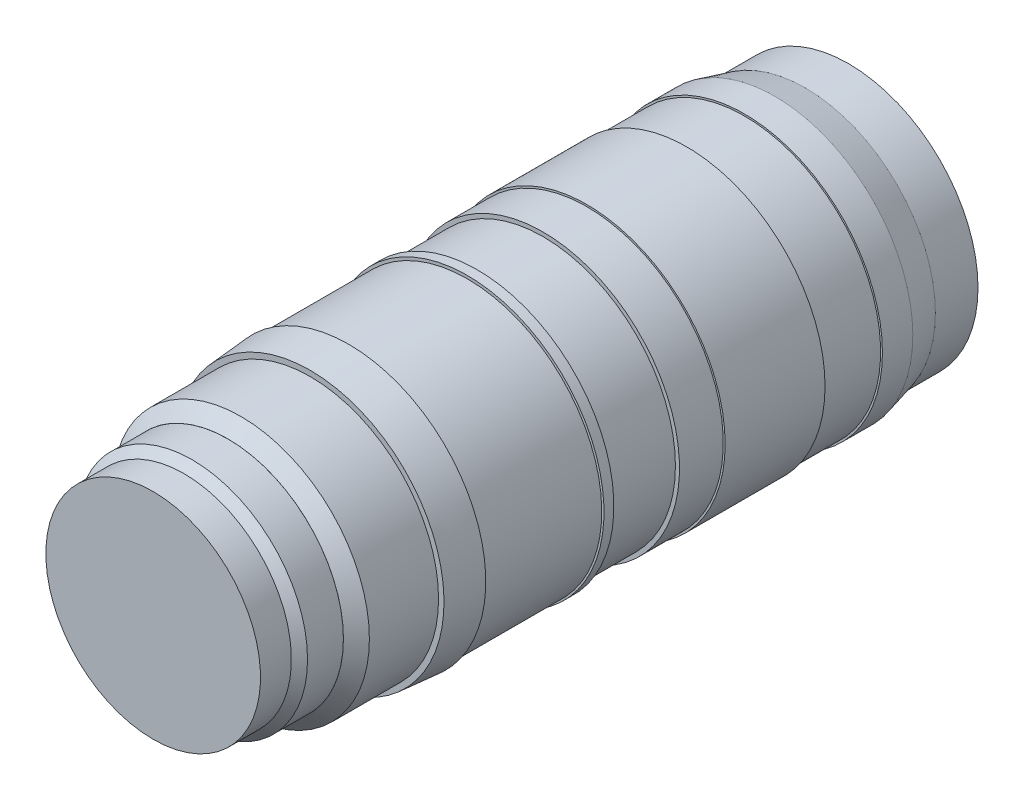
ISO-10303-21;
HEADER;
FILE_DESCRIPTION(('STEP AP214'),'2;1');
FILE_NAME('part.step','',(''),(''),'','','');
FILE_SCHEMA(('AUTOMOTIVE_DESIGN { 1 0 10303 214 1 1 1 1 }'));
ENDSEC;
DATA;
#1=APPLICATION_CONTEXT('core data for automotive mechanical design processes');
#2=APPLICATION_PROTOCOL_DEFINITION('international standard','automotive_design',2000,#1);
#3=PRODUCT_CONTEXT('',#1,'mechanical');
#4=PRODUCT('Part','Part','',(#3));
#5=PRODUCT_RELATED_PRODUCT_CATEGORY('part','',(#4));
#6=PRODUCT_DEFINITION_FORMATION('','',#4);
#7=PRODUCT_DEFINITION_CONTEXT('part definition',#1,'design');
#8=PRODUCT_DEFINITION('design','',#6,#7);
#9=PRODUCT_DEFINITION_SHAPE('','',#8);
#10=(LENGTH_UNIT() NAMED_UNIT(*) SI_UNIT(.MILLI.,.METRE.));
#11=(NAMED_UNIT(*) PLANE_ANGLE_UNIT() SI_UNIT($,.RADIAN.));
#12=(NAMED_UNIT(*) SI_UNIT($,.STERADIAN.) SOLID_ANGLE_UNIT());
#13=UNCERTAINTY_MEASURE_WITH_UNIT(LENGTH_MEASURE(1.E-05),#10,'distance_accuracy_value','');
#14=(GEOMETRIC_REPRESENTATION_CONTEXT(3) GLOBAL_UNCERTAINTY_ASSIGNED_CONTEXT((#13)) GLOBAL_UNIT_ASSIGNED_CONTEXT((#10,
#11,#12)) REPRESENTATION_CONTEXT('',''));
#15=CARTESIAN_POINT('',(0.,0.,0.));
#16=DIRECTION('',(0.,0.,1.));
#17=DIRECTION('',(1.,0.,0.));
#18=AXIS2_PLACEMENT_3D('',#15,#16,#17);
#19=CARTESIAN_POINT('',(0.,-0.223974787347825,203.2));
#20=DIRECTION('',(0.,0.,1.));
#21=DIRECTION('',(0.,-1.,0.));
#22=AXIS2_PLACEMENT_3D('',#19,#20,#21);
#23=PLANE('',#22);
#24=CARTESIAN_POINT('',(0.,-0.223974787347825,203.2));
#25=DIRECTION('',(0.,0.,-1.));
#26=DIRECTION('',(0.,1.,0.));
#27=AXIS2_PLACEMENT_3D('',#24,#25,#26);
#28=CIRCLE('',#27,32.595);
#29=CARTESIAN_POINT('',(0.,32.3710252126522,203.2));
#30=VERTEX_POINT('',#29);
#31=EDGE_CURVE('E135',#30,#30,#28,.T.);
#32=ORIENTED_EDGE('',*,*,#31,.F.);
#33=EDGE_LOOP('',(#32));
#34=FACE_BOUND('',#33,.T.);
#35=ADVANCED_FACE('F38',(#34),#23,.T.);
#36=CARTESIAN_POINT('',(0.,-0.223974787347814,107.78));
#37=DIRECTION('',(0.,0.,-1.));
#38=DIRECTION('',(0.,1.,0.));
#39=AXIS2_PLACEMENT_3D('',#36,#37,#38);
#40=CYLINDRICAL_SURFACE('',#39,32.595);
#41=CARTESIAN_POINT('',(0.,-0.223974787347824,193.81));
#42=DIRECTION('',(0.,0.,-1.));
#43=DIRECTION('',(0.,1.,0.));
#44=AXIS2_PLACEMENT_3D('',#41,#42,#43);
#45=CIRCLE('',#44,32.595);
#46=CARTESIAN_POINT('',(0.,32.3710252126522,193.81));
#47=VERTEX_POINT('',#46);
#48=EDGE_CURVE('E42',#47,#47,#45,.F.);
#49=ORIENTED_EDGE('',*,*,#48,.T.);
#50=EDGE_LOOP('',(#49));
#51=FACE_BOUND('',#50,.T.);
#52=ORIENTED_EDGE('',*,*,#31,.T.);
#53=EDGE_LOOP('',(#52));
#54=FACE_BOUND('',#53,.T.);
#55=ADVANCED_FACE('F169',(#51,#54),#40,.T.);
#56=CARTESIAN_POINT('',(0.,-0.223974787347814,107.78));
#57=DIRECTION('',(0.,0.,-1.));
#58=DIRECTION('',(0.,1.,0.));
#59=AXIS2_PLACEMENT_3D('',#56,#57,#58);
#60=CYLINDRICAL_SURFACE('',#59,35.045);
#61=CARTESIAN_POINT('',(0.,-0.223974787347824,191.36));
#62=DIRECTION('',(0.,0.,1.));
#63=DIRECTION('',(0.,-1.,0.));
#64=AXIS2_PLACEMENT_3D('',#61,#62,#63);
#65=CIRCLE('',#64,35.045);
#66=CARTESIAN_POINT('',(0.,-35.2689747873478,191.36));
#67=VERTEX_POINT('',#66);
#68=EDGE_CURVE('E54',#67,#67,#65,.F.);
#69=ORIENTED_EDGE('',*,*,#68,.T.);
#70=EDGE_LOOP('',(#69));
#71=FACE_BOUND('',#70,.T.);
#72=CARTESIAN_POINT('',(0.,-0.223974787347823,180.47));
#73=DIRECTION('',(0.,0.,-1.));
#74=DIRECTION('',(0.,1.,0.));
#75=AXIS2_PLACEMENT_3D('',#72,#73,#74);
#76=CIRCLE('',#75,35.045);
#77=CARTESIAN_POINT('',(0.,34.8210252126522,180.47));
#78=VERTEX_POINT('',#77);
#79=EDGE_CURVE('E131',#78,#78,#76,.T.);
#80=ORIENTED_EDGE('',*,*,#79,.F.);
#81=EDGE_LOOP('',(#80));
#82=FACE_BOUND('',#81,.T.);
#83=ADVANCED_FACE('F151',(#71,#82),#60,.T.);
#84=CARTESIAN_POINT('',(0.,34.8210252126522,180.47));
#85=DIRECTION('',(0.,0.,1.));
#86=DIRECTION('',(0.,-1.,0.));
#87=AXIS2_PLACEMENT_3D('',#84,#85,#86);
#88=PLANE('',#87);
#89=CARTESIAN_POINT('',(0.,-0.223974787347823,180.47));
#90=DIRECTION('',(0.,0.,1.));
#91=DIRECTION('',(0.,-1.,0.));
#92=AXIS2_PLACEMENT_3D('',#89,#90,#91);
#93=CIRCLE('',#92,35.0629999999999);
#94=CARTESIAN_POINT('',(0.,-35.2869747873478,180.47));
#95=VERTEX_POINT('',#94);
#96=EDGE_CURVE('E143',#95,#95,#93,.T.);
#97=ORIENTED_EDGE('',*,*,#96,.T.);
#98=EDGE_LOOP('',(#97));
#99=FACE_BOUND('',#98,.T.);
#100=ORIENTED_EDGE('',*,*,#79,.T.);
#101=EDGE_LOOP('',(#100));
#102=FACE_BOUND('',#101,.T.);
#103=ADVANCED_FACE('F181',(#99,#102),#88,.T.);
#104=CARTESIAN_POINT('',(0.,-0.223974787347814,107.78));
#105=DIRECTION('',(0.,0.,-1.));
#106=DIRECTION('',(0.,1.,0.));
#107=AXIS2_PLACEMENT_3D('',#104,#105,#106);
#108=CYLINDRICAL_SURFACE('',#107,39.);
#109=CARTESIAN_POINT('',(0.,-0.223974787347822,176.533));
#110=DIRECTION('',(0.,0.,1.));
#111=DIRECTION('',(0.,-1.,0.));
#112=AXIS2_PLACEMENT_3D('',#109,#110,#111);
#113=CIRCLE('',#112,39.);
#114=CARTESIAN_POINT('',(0.,-39.2239747873478,176.533));
#115=VERTEX_POINT('',#114);
#116=EDGE_CURVE('E139',#115,#115,#113,.F.);
#117=ORIENTED_EDGE('',*,*,#116,.T.);
#118=EDGE_LOOP('',(#117));
#119=FACE_BOUND('',#118,.T.);
#120=CARTESIAN_POINT('',(0.,-0.22397478734782,155.52));
#121=DIRECTION('',(0.,0.,-1.));
#122=DIRECTION('',(0.,1.,0.));
#123=AXIS2_PLACEMENT_3D('',#120,#121,#122);
#124=CIRCLE('',#123,39.);
#125=CARTESIAN_POINT('',(0.,38.7760252126522,155.52));
#126=VERTEX_POINT('',#125);
#127=EDGE_CURVE('E127',#126,#126,#124,.T.);
#128=ORIENTED_EDGE('',*,*,#127,.F.);
#129=EDGE_LOOP('',(#128));
#130=FACE_BOUND('',#129,.T.);
#131=ADVANCED_FACE('F184',(#119,#130),#108,.T.);
#132=CARTESIAN_POINT('',(0.,38.7760252126522,155.52));
#133=DIRECTION('',(0.,0.,1.));
#134=DIRECTION('',(0.,-1.,0.));
#135=AXIS2_PLACEMENT_3D('',#132,#133,#134);
#136=PLANE('',#135);
#137=ORIENTED_EDGE('',*,*,#127,.T.);
#138=EDGE_LOOP('',(#137));
#139=FACE_BOUND('',#138,.T.);
#140=CARTESIAN_POINT('',(0.,-0.22397478734782,155.52));
#141=DIRECTION('',(0.,0.,-1.));
#142=DIRECTION('',(0.,1.,0.));
#143=AXIS2_PLACEMENT_3D('',#140,#141,#142);
#144=CIRCLE('',#143,40.65);
#145=CARTESIAN_POINT('',(0.,40.4260252126522,155.52));
#146=VERTEX_POINT('',#145);
#147=EDGE_CURVE('E123',#146,#146,#144,.T.);
#148=ORIENTED_EDGE('',*,*,#147,.F.);
#149=EDGE_LOOP('',(#148));
#150=FACE_BOUND('',#149,.T.);
#151=ADVANCED_FACE('F188',(#139,#150),#136,.T.);
#152=CARTESIAN_POINT('',(0.,-0.223974787347818,143.78));
#153=DIRECTION('',(0.,0.,-1.));
#154=DIRECTION('',(0.,1.,0.));
#155=AXIS2_PLACEMENT_3D('',#152,#153,#154);
#156=CONICAL_SURFACE('',#155,41.6,0.0807440003527652);
#157=ORIENTED_EDGE('',*,*,#147,.T.);
#158=EDGE_LOOP('',(#157));
#159=FACE_BOUND('',#158,.T.);
#160=CARTESIAN_POINT('',(0.,-0.223974787347818,143.78));
#161=DIRECTION('',(0.,0.,-1.));
#162=DIRECTION('',(0.,1.,0.));
#163=AXIS2_PLACEMENT_3D('',#160,#161,#162);
#164=CIRCLE('',#163,41.6);
#165=CARTESIAN_POINT('',(0.,41.3760252126522,143.78));
#166=VERTEX_POINT('',#165);
#167=EDGE_CURVE('E119',#166,#166,#164,.T.);
#168=ORIENTED_EDGE('',*,*,#167,.F.);
#169=EDGE_LOOP('',(#168));
#170=FACE_BOUND('',#169,.T.);
#171=ADVANCED_FACE('F192',(#159,#170),#156,.T.);
#172=CARTESIAN_POINT('',(0.,41.3760252126522,143.78));
#173=DIRECTION('',(0.,0.,-1.));
#174=DIRECTION('',(0.,1.,0.));
#175=AXIS2_PLACEMENT_3D('',#172,#173,#174);
#176=PLANE('',#175);
#177=ORIENTED_EDGE('',*,*,#167,.T.);
#178=EDGE_LOOP('',(#177));
#179=FACE_BOUND('',#178,.T.);
#180=CARTESIAN_POINT('',(0.,-0.223974787347818,143.78));
#181=DIRECTION('',(0.,0.,-1.));
#182=DIRECTION('',(0.,1.,0.));
#183=AXIS2_PLACEMENT_3D('',#180,#181,#182);
#184=CIRCLE('',#183,40.825);
#185=CARTESIAN_POINT('',(0.,40.6010252126522,143.78));
#186=VERTEX_POINT('',#185);
#187=EDGE_CURVE('E115',#186,#186,#184,.T.);
#188=ORIENTED_EDGE('',*,*,#187,.F.);
#189=EDGE_LOOP('',(#188));
#190=FACE_BOUND('',#189,.T.);
#191=ADVANCED_FACE('F196',(#179,#190),#176,.T.);
#192=CARTESIAN_POINT('',(0.,-0.223974787347814,107.78));
#193=DIRECTION('',(0.,0.,-1.));
#194=DIRECTION('',(0.,1.,0.));
#195=AXIS2_PLACEMENT_3D('',#192,#193,#194);
#196=CYLINDRICAL_SURFACE('',#195,40.825);
#197=ORIENTED_EDGE('',*,*,#187,.T.);
#198=EDGE_LOOP('',(#197));
#199=FACE_BOUND('',#198,.T.);
#200=CARTESIAN_POINT('',(0.,-0.223974787347814,107.78));
#201=DIRECTION('',(0.,0.,-1.));
#202=DIRECTION('',(0.,1.,0.));
#203=AXIS2_PLACEMENT_3D('',#200,#201,#202);
#204=CIRCLE('',#203,40.825);
#205=CARTESIAN_POINT('',(0.,40.6010252126522,107.78));
#206=VERTEX_POINT('',#205);
#207=EDGE_CURVE('E111',#206,#206,#204,.T.);
#208=ORIENTED_EDGE('',*,*,#207,.F.);
#209=EDGE_LOOP('',(#208));
#210=FACE_BOUND('',#209,.T.);
#211=ADVANCED_FACE('F165',(#199,#210),#196,.T.);
#212=CARTESIAN_POINT('',(0.,-0.223974787347822,176.533));
#213=DIRECTION('',(0.,0.,-1.));
#214=DIRECTION('',(0.,1.,0.));
#215=AXIS2_PLACEMENT_3D('',#212,#213,#214);
#216=CONICAL_SURFACE('',#215,39.,0.785398163397454);
#217=ORIENTED_EDGE('',*,*,#96,.F.);
#218=EDGE_LOOP('',(#217));
#219=FACE_BOUND('',#218,.T.);
#220=ORIENTED_EDGE('',*,*,#116,.F.);
#221=EDGE_LOOP('',(#220));
#222=FACE_BOUND('',#221,.T.);
#223=ADVANCED_FACE('F156',(#219,#222),#216,.T.);
#224=CARTESIAN_POINT('',(0.,-0.223974787347824,191.36));
#225=DIRECTION('',(0.,0.,-1.));
#226=DIRECTION('',(0.,1.,0.));
#227=AXIS2_PLACEMENT_3D('',#224,#225,#226);
#228=CONICAL_SURFACE('',#227,35.045,0.785398163397444);
#229=ORIENTED_EDGE('',*,*,#48,.F.);
#230=EDGE_LOOP('',(#229));
#231=FACE_BOUND('',#230,.T.);
#232=ORIENTED_EDGE('',*,*,#68,.F.);
#233=EDGE_LOOP('',(#232));
#234=FACE_BOUND('',#233,.T.);
#235=ADVANCED_FACE('F40',(#231,#234),#228,.T.);
#236=CARTESIAN_POINT('',(-40.825,0.,107.78));
#237=DIRECTION('',(0.,0.,1.));
#238=DIRECTION('',(1.,0.,0.));
#239=AXIS2_PLACEMENT_3D('',#236,#237,#238);
#240=PLANE('',#239);
#241=ORIENTED_EDGE('',*,*,#207,.T.);
#242=EDGE_LOOP('',(#241));
#243=FACE_BOUND('',#242,.T.);
#244=CARTESIAN_POINT('',(0.,0.,107.78));
#245=DIRECTION('',(0.,0.,-1.));
#246=DIRECTION('',(-1.,0.,0.));
#247=AXIS2_PLACEMENT_3D('',#244,#245,#246);
#248=CIRCLE('',#247,41.5);
#249=CARTESIAN_POINT('',(-41.5,0.,107.78));
#250=VERTEX_POINT('',#249);
#251=EDGE_CURVE('E107',#250,#250,#248,.T.);
#252=ORIENTED_EDGE('',*,*,#251,.F.);
#253=EDGE_LOOP('',(#252));
#254=FACE_BOUND('',#253,.T.);
#255=ADVANCED_FACE('F155',(#243,#254),#240,.T.);
#256=CARTESIAN_POINT('',(0.,0.,5.12999999999998));
#257=DIRECTION('',(0.,0.,-1.));
#258=DIRECTION('',(-1.,0.,0.));
#259=AXIS2_PLACEMENT_3D('',#256,#257,#258);
#260=CYLINDRICAL_SURFACE('',#259,41.5);
#261=ORIENTED_EDGE('',*,*,#251,.T.);
#262=EDGE_LOOP('',(#261));
#263=FACE_BOUND('',#262,.T.);
#264=CARTESIAN_POINT('',(0.,0.,104.78));
#265=DIRECTION('',(0.,0.,-1.));
#266=DIRECTION('',(-1.,0.,0.));
#267=AXIS2_PLACEMENT_3D('',#264,#265,#266);
#268=CIRCLE('',#267,41.5);
#269=CARTESIAN_POINT('',(-41.5,0.,104.78));
#270=VERTEX_POINT('',#269);
#271=EDGE_CURVE('E103',#270,#270,#268,.T.);
#272=ORIENTED_EDGE('',*,*,#271,.F.);
#273=EDGE_LOOP('',(#272));
#274=FACE_BOUND('',#273,.T.);
#275=ADVANCED_FACE('F162',(#263,#274),#260,.T.);
#276=CARTESIAN_POINT('',(-41.5,0.,104.78));
#277=DIRECTION('',(0.,0.,-1.));
#278=DIRECTION('',(-1.,0.,0.));
#279=AXIS2_PLACEMENT_3D('',#276,#277,#278);
#280=PLANE('',#279);
#281=ORIENTED_EDGE('',*,*,#271,.T.);
#282=EDGE_LOOP('',(#281));
#283=FACE_BOUND('',#282,.T.);
#284=CARTESIAN_POINT('',(0.,0.,104.78));
#285=DIRECTION('',(0.,0.,-1.));
#286=DIRECTION('',(-1.,0.,0.));
#287=AXIS2_PLACEMENT_3D('',#284,#285,#286);
#288=CIRCLE('',#287,40.2);
#289=CARTESIAN_POINT('',(-40.2,0.,104.78));
#290=VERTEX_POINT('',#289);
#291=EDGE_CURVE('E99',#290,#290,#288,.T.);
#292=ORIENTED_EDGE('',*,*,#291,.F.);
#293=EDGE_LOOP('',(#292));
#294=FACE_BOUND('',#293,.T.);
#295=ADVANCED_FACE('F206',(#283,#294),#280,.T.);
#296=CARTESIAN_POINT('',(0.,0.,5.12999999999998));
#297=DIRECTION('',(0.,0.,-1.));
#298=DIRECTION('',(-1.,0.,0.));
#299=AXIS2_PLACEMENT_3D('',#296,#297,#298);
#300=CYLINDRICAL_SURFACE('',#299,40.2);
#301=ORIENTED_EDGE('',*,*,#291,.T.);
#302=EDGE_LOOP('',(#301));
#303=FACE_BOUND('',#302,.T.);
#304=CARTESIAN_POINT('',(0.,0.,84.78));
#305=DIRECTION('',(0.,0.,-1.));
#306=DIRECTION('',(-1.,0.,0.));
#307=AXIS2_PLACEMENT_3D('',#304,#305,#306);
#308=CIRCLE('',#307,40.2);
#309=CARTESIAN_POINT('',(-40.2,0.,84.78));
#310=VERTEX_POINT('',#309);
#311=EDGE_CURVE('E95',#310,#310,#308,.T.);
#312=ORIENTED_EDGE('',*,*,#311,.F.);
#313=EDGE_LOOP('',(#312));
#314=FACE_BOUND('',#313,.T.);
#315=ADVANCED_FACE('F210',(#303,#314),#300,.T.);
#316=CARTESIAN_POINT('',(-40.2,0.,84.78));
#317=DIRECTION('',(0.,0.,1.));
#318=DIRECTION('',(1.,0.,0.));
#319=AXIS2_PLACEMENT_3D('',#316,#317,#318);
#320=PLANE('',#319);
#321=ORIENTED_EDGE('',*,*,#311,.T.);
#322=EDGE_LOOP('',(#321));
#323=FACE_BOUND('',#322,.T.);
#324=CARTESIAN_POINT('',(0.,0.,84.78));
#325=DIRECTION('',(0.,0.,-1.));
#326=DIRECTION('',(-1.,0.,0.));
#327=AXIS2_PLACEMENT_3D('',#324,#325,#326);
#328=CIRCLE('',#327,41.43);
#329=CARTESIAN_POINT('',(-41.43,0.,84.78));
#330=VERTEX_POINT('',#329);
#331=EDGE_CURVE('E91',#330,#330,#328,.T.);
#332=ORIENTED_EDGE('',*,*,#331,.F.);
#333=EDGE_LOOP('',(#332));
#334=FACE_BOUND('',#333,.T.);
#335=ADVANCED_FACE('F214',(#323,#334),#320,.T.);
#336=CARTESIAN_POINT('',(0.,0.,5.12999999999998));
#337=DIRECTION('',(0.,0.,-1.));
#338=DIRECTION('',(-1.,0.,0.));
#339=AXIS2_PLACEMENT_3D('',#336,#337,#338);
#340=CYLINDRICAL_SURFACE('',#339,41.43);
#341=ORIENTED_EDGE('',*,*,#331,.T.);
#342=EDGE_LOOP('',(#341));
#343=FACE_BOUND('',#342,.T.);
#344=CARTESIAN_POINT('',(0.,0.,71.48));
#345=DIRECTION('',(0.,0.,-1.));
#346=DIRECTION('',(-1.,0.,0.));
#347=AXIS2_PLACEMENT_3D('',#344,#345,#346);
#348=CIRCLE('',#347,41.43);
#349=CARTESIAN_POINT('',(-41.43,0.,71.48));
#350=VERTEX_POINT('',#349);
#351=EDGE_CURVE('E87',#350,#350,#348,.T.);
#352=ORIENTED_EDGE('',*,*,#351,.F.);
#353=EDGE_LOOP('',(#352));
#354=FACE_BOUND('',#353,.T.);
#355=ADVANCED_FACE('F218',(#343,#354),#340,.T.);
#356=CARTESIAN_POINT('',(-41.43,0.,71.48));
#357=DIRECTION('',(0.,0.,1.));
#358=DIRECTION('',(1.,0.,0.));
#359=AXIS2_PLACEMENT_3D('',#356,#357,#358);
#360=PLANE('',#359);
#361=ORIENTED_EDGE('',*,*,#351,.T.);
#362=EDGE_LOOP('',(#361));
#363=FACE_BOUND('',#362,.T.);
#364=CARTESIAN_POINT('',(0.,0.,71.48));
#365=DIRECTION('',(0.,0.,-1.));
#366=DIRECTION('',(-1.,0.,0.));
#367=AXIS2_PLACEMENT_3D('',#364,#365,#366);
#368=CIRCLE('',#367,42.);
#369=CARTESIAN_POINT('',(-42.,0.,71.48));
#370=VERTEX_POINT('',#369);
#371=EDGE_CURVE('E83',#370,#370,#368,.T.);
#372=ORIENTED_EDGE('',*,*,#371,.F.);
#373=EDGE_LOOP('',(#372));
#374=FACE_BOUND('',#373,.T.);
#375=ADVANCED_FACE('F222',(#363,#374),#360,.T.);
#376=CARTESIAN_POINT('',(0.,0.,5.12999999999998));
#377=DIRECTION('',(0.,0.,-1.));
#378=DIRECTION('',(-1.,0.,0.));
#379=AXIS2_PLACEMENT_3D('',#376,#377,#378);
#380=CYLINDRICAL_SURFACE('',#379,42.);
#381=ORIENTED_EDGE('',*,*,#371,.T.);
#382=EDGE_LOOP('',(#381));
#383=FACE_BOUND('',#382,.T.);
#384=CARTESIAN_POINT('',(0.,0.,41.14));
#385=DIRECTION('',(0.,0.,-1.));
#386=DIRECTION('',(-1.,0.,0.));
#387=AXIS2_PLACEMENT_3D('',#384,#385,#386);
#388=CIRCLE('',#387,42.);
#389=CARTESIAN_POINT('',(-42.,0.,41.14));
#390=VERTEX_POINT('',#389);
#391=EDGE_CURVE('E79',#390,#390,#388,.T.);
#392=ORIENTED_EDGE('',*,*,#391,.F.);
#393=EDGE_LOOP('',(#392));
#394=FACE_BOUND('',#393,.T.);
#395=ADVANCED_FACE('F226',(#383,#394),#380,.T.);
#396=CARTESIAN_POINT('',(-42.,0.,41.14));
#397=DIRECTION('',(0.,0.,-1.));
#398=DIRECTION('',(-1.,0.,0.));
#399=AXIS2_PLACEMENT_3D('',#396,#397,#398);
#400=PLANE('',#399);
#401=ORIENTED_EDGE('',*,*,#391,.T.);
#402=EDGE_LOOP('',(#401));
#403=FACE_BOUND('',#402,.T.);
#404=CARTESIAN_POINT('',(0.,0.,41.14));
#405=DIRECTION('',(0.,0.,-1.));
#406=DIRECTION('',(-1.,0.,0.));
#407=AXIS2_PLACEMENT_3D('',#404,#405,#406);
#408=CIRCLE('',#407,41.35);
#409=CARTESIAN_POINT('',(-41.35,0.,41.14));
#410=VERTEX_POINT('',#409);
#411=EDGE_CURVE('E75',#410,#410,#408,.T.);
#412=ORIENTED_EDGE('',*,*,#411,.F.);
#413=EDGE_LOOP('',(#412));
#414=FACE_BOUND('',#413,.T.);
#415=ADVANCED_FACE('F230',(#403,#414),#400,.T.);
#416=CARTESIAN_POINT('',(0.,0.,5.12999999999998));
#417=DIRECTION('',(0.,0.,-1.));
#418=DIRECTION('',(-1.,0.,0.));
#419=AXIS2_PLACEMENT_3D('',#416,#417,#418);
#420=CYLINDRICAL_SURFACE('',#419,41.35);
#421=ORIENTED_EDGE('',*,*,#411,.T.);
#422=EDGE_LOOP('',(#421));
#423=FACE_BOUND('',#422,.T.);
#424=CARTESIAN_POINT('',(0.,0.,23.61));
#425=DIRECTION('',(0.,0.,-1.));
#426=DIRECTION('',(-1.,0.,0.));
#427=AXIS2_PLACEMENT_3D('',#424,#425,#426);
#428=CIRCLE('',#427,41.35);
#429=CARTESIAN_POINT('',(-41.35,0.,23.61));
#430=VERTEX_POINT('',#429);
#431=EDGE_CURVE('E71',#430,#430,#428,.T.);
#432=ORIENTED_EDGE('',*,*,#431,.F.);
#433=EDGE_LOOP('',(#432));
#434=FACE_BOUND('',#433,.T.);
#435=ADVANCED_FACE('F234',(#423,#434),#420,.T.);
#436=CARTESIAN_POINT('',(-41.35,0.,23.61));
#437=DIRECTION('',(0.,0.,1.));
#438=DIRECTION('',(1.,0.,0.));
#439=AXIS2_PLACEMENT_3D('',#436,#437,#438);
#440=PLANE('',#439);
#441=ORIENTED_EDGE('',*,*,#431,.T.);
#442=EDGE_LOOP('',(#441));
#443=FACE_BOUND('',#442,.T.);
#444=CARTESIAN_POINT('',(0.,0.,23.61));
#445=DIRECTION('',(0.,0.,-1.));
#446=DIRECTION('',(-1.,0.,0.));
#447=AXIS2_PLACEMENT_3D('',#444,#445,#446);
#448=CIRCLE('',#447,41.905);
#449=CARTESIAN_POINT('',(-41.905,0.,23.61));
#450=VERTEX_POINT('',#449);
#451=EDGE_CURVE('E67',#450,#450,#448,.T.);
#452=ORIENTED_EDGE('',*,*,#451,.F.);
#453=EDGE_LOOP('',(#452));
#454=FACE_BOUND('',#453,.T.);
#455=ADVANCED_FACE('F238',(#443,#454),#440,.T.);
#456=CARTESIAN_POINT('',(0.,0.,5.12999999999998));
#457=DIRECTION('',(0.,0.,-1.));
#458=DIRECTION('',(-1.,0.,0.));
#459=AXIS2_PLACEMENT_3D('',#456,#457,#458);
#460=CYLINDRICAL_SURFACE('',#459,41.905);
#461=ORIENTED_EDGE('',*,*,#451,.T.);
#462=EDGE_LOOP('',(#461));
#463=FACE_BOUND('',#462,.T.);
#464=CARTESIAN_POINT('',(0.,0.,14.39));
#465=DIRECTION('',(0.,0.,-1.));
#466=DIRECTION('',(-1.,0.,0.));
#467=AXIS2_PLACEMENT_3D('',#464,#465,#466);
#468=CIRCLE('',#467,41.905);
#469=CARTESIAN_POINT('',(-41.905,0.,14.39));
#470=VERTEX_POINT('',#469);
#471=EDGE_CURVE('E63',#470,#470,#468,.T.);
#472=ORIENTED_EDGE('',*,*,#471,.F.);
#473=EDGE_LOOP('',(#472));
#474=FACE_BOUND('',#473,.T.);
#475=ADVANCED_FACE('F242',(#463,#474),#460,.T.);
#476=CARTESIAN_POINT('',(0.,0.,5.12999999999998));
#477=DIRECTION('',(0.,0.,1.));
#478=DIRECTION('',(1.,0.,0.));
#479=AXIS2_PLACEMENT_3D('',#476,#477,#478);
#480=CONICAL_SURFACE('',#479,39.5,0.254105041756603);
#481=ORIENTED_EDGE('',*,*,#471,.T.);
#482=EDGE_LOOP('',(#481));
#483=FACE_BOUND('',#482,.T.);
#484=CARTESIAN_POINT('',(0.,0.,5.12999999999998));
#485=DIRECTION('',(0.,0.,-1.));
#486=DIRECTION('',(-1.,0.,0.));
#487=AXIS2_PLACEMENT_3D('',#484,#485,#486);
#488=CIRCLE('',#487,39.5);
#489=CARTESIAN_POINT('',(-39.5,0.,5.12999999999998));
#490=VERTEX_POINT('',#489);
#491=EDGE_CURVE('E59',#490,#490,#488,.T.);
#492=ORIENTED_EDGE('',*,*,#491,.F.);
#493=EDGE_LOOP('',(#492));
#494=FACE_BOUND('',#493,.T.);
#495=ADVANCED_FACE('F246',(#483,#494),#480,.T.);
#496=CARTESIAN_POINT('',(-39.5,0.,5.12999999999998));
#497=DIRECTION('',(0.,0.,-1.));
#498=DIRECTION('',(-1.,0.,0.));
#499=AXIS2_PLACEMENT_3D('',#496,#497,#498);
#500=PLANE('',#499);
#501=CARTESIAN_POINT('',(0.,0.,5.12999999999998));
#502=DIRECTION('',(0.,0.,-1.));
#503=DIRECTION('',(-1.,0.,0.));
#504=AXIS2_PLACEMENT_3D('',#501,#502,#503);
#505=CIRCLE('',#504,39.2928763537);
#506=CARTESIAN_POINT('',(-39.2928763537,0.,5.12999999999998));
#507=VERTEX_POINT('',#506);
#508=EDGE_CURVE('E10',#507,#507,#505,.T.);
#509=ORIENTED_EDGE('',*,*,#508,.F.);
#510=EDGE_LOOP('',(#509));
#511=FACE_BOUND('',#510,.T.);
#512=ORIENTED_EDGE('',*,*,#491,.T.);
#513=EDGE_LOOP('',(#512));
#514=FACE_BOUND('',#513,.T.);
#515=ADVANCED_FACE('F250',(#511,#514),#500,.T.);
#516=CARTESIAN_POINT('',(0.,0.,-8.02000000000003));
#517=DIRECTION('',(0.,0.,1.));
#518=DIRECTION('',(1.,0.,0.));
#519=AXIS2_PLACEMENT_3D('',#516,#517,#518);
#520=CYLINDRICAL_SURFACE('',#519,39.2928763537);
#521=CARTESIAN_POINT('',(0.,0.,-8.02000000000003));
#522=DIRECTION('',(0.,0.,-1.));
#523=DIRECTION('',(-1.,0.,0.));
#524=AXIS2_PLACEMENT_3D('',#521,#522,#523);
#525=CIRCLE('',#524,39.2928763537);
#526=CARTESIAN_POINT('',(-39.2928763537,0.,-8.02000000000003));
#527=VERTEX_POINT('',#526);
#528=EDGE_CURVE('E57',#527,#527,#525,.T.);
#529=ORIENTED_EDGE('',*,*,#528,.F.);
#530=EDGE_LOOP('',(#529));
#531=FACE_BOUND('',#530,.T.);
#532=ORIENTED_EDGE('',*,*,#508,.T.);
#533=EDGE_LOOP('',(#532));
#534=FACE_BOUND('',#533,.T.);
#535=ADVANCED_FACE('F254',(#531,#534),#520,.T.);
#536=CARTESIAN_POINT('',(0.,0.,-8.02000000000003));
#537=DIRECTION('',(0.,0.,-1.));
#538=DIRECTION('',(-1.,0.,0.));
#539=AXIS2_PLACEMENT_3D('',#536,#537,#538);
#540=PLANE('',#539);
#541=CARTESIAN_POINT('',(0.,0.,-8.02000000000003));
#542=DIRECTION('',(0.,0.,-1.));
#543=DIRECTION('',(-1.,0.,0.));
#544=AXIS2_PLACEMENT_3D('',#541,#542,#543);
#545=CIRCLE('',#544,37.648699114336);
#546=CARTESIAN_POINT('',(-37.648699114336,0.,-8.02000000000003));
#547=VERTEX_POINT('',#546);
#548=EDGE_CURVE('E275',#547,#547,#545,.T.);
#549=ORIENTED_EDGE('',*,*,#548,.F.);
#550=EDGE_LOOP('',(#549));
#551=FACE_BOUND('',#550,.T.);
#552=ORIENTED_EDGE('',*,*,#528,.T.);
#553=EDGE_LOOP('',(#552));
#554=FACE_BOUND('',#553,.T.);
#555=ADVANCED_FACE('F258',(#551,#554),#540,.T.);
#556=CARTESIAN_POINT('',(0.,0.,-6.02000000000003));
#557=DIRECTION('',(0.,0.,-1.));
#558=DIRECTION('',(-1.,0.,0.));
#559=AXIS2_PLACEMENT_3D('',#556,#557,#558);
#560=CYLINDRICAL_SURFACE('',#559,37.648699114336);
#561=CARTESIAN_POINT('',(0.,0.,-6.02000000000003));
#562=DIRECTION('',(0.,0.,-1.));
#563=DIRECTION('',(-1.,0.,0.));
#564=AXIS2_PLACEMENT_3D('',#561,#562,#563);
#565=CIRCLE('',#564,37.648699114336);
#566=CARTESIAN_POINT('',(-37.648699114336,0.,-6.02000000000003));
#567=VERTEX_POINT('',#566);
#568=EDGE_CURVE('E273',#567,#567,#565,.T.);
#569=ORIENTED_EDGE('',*,*,#568,.F.);
#570=EDGE_LOOP('',(#569));
#571=FACE_BOUND('',#570,.T.);
#572=ORIENTED_EDGE('',*,*,#548,.T.);
#573=EDGE_LOOP('',(#572));
#574=FACE_BOUND('',#573,.T.);
#575=ADVANCED_FACE('F262',(#571,#574),#560,.F.);
#576=CARTESIAN_POINT('',(0.,0.,-6.02000000000003));
#577=DIRECTION('',(0.,0.,-1.));
#578=DIRECTION('',(-1.,0.,0.));
#579=AXIS2_PLACEMENT_3D('',#576,#577,#578);
#580=PLANE('',#579);
#581=ORIENTED_EDGE('',*,*,#568,.T.);
#582=EDGE_LOOP('',(#581));
#583=FACE_BOUND('',#582,.T.);
#584=ADVANCED_FACE('F266',(#583),#580,.T.);
#585=CLOSED_SHELL('',(#35,#55,#83,#103,#131,#151,#171,#191,#211,#223,#235,#255,#275,#295,#315,
#335,#355,#375,#395,#415,#435,#455,#475,#495,#515,#535,#555,#575,#584));
#586=MANIFOLD_SOLID_BREP('B2',#585);
#587=ADVANCED_BREP_SHAPE_REPRESENTATION('',(#18,#586),#14);
#588=SHAPE_DEFINITION_REPRESENTATION(#9,#587);
ENDSEC;
END-ISO-10303-21;
